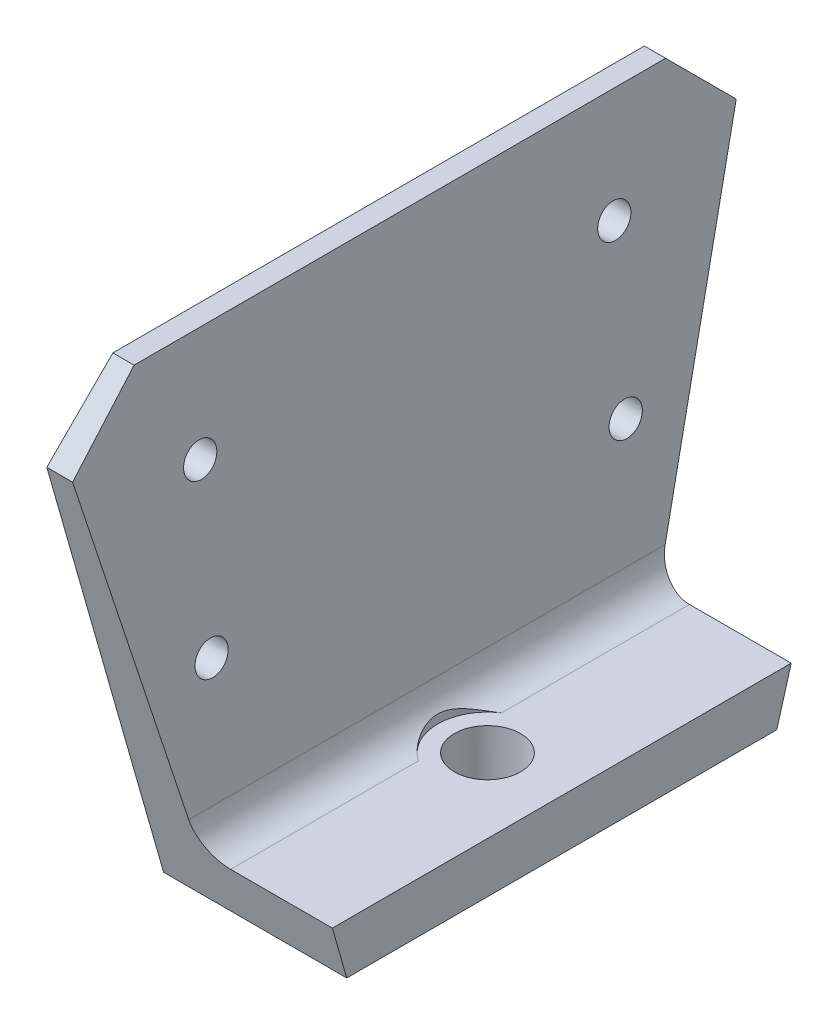
ISO-10303-21;
HEADER;
FILE_DESCRIPTION(('STEP AP214'),'2;1');
FILE_NAME('part.step','',(''),(''),'','','');
FILE_SCHEMA(('AUTOMOTIVE_DESIGN { 1 0 10303 214 1 1 1 1 }'));
ENDSEC;
DATA;
#1=APPLICATION_CONTEXT('core data for automotive mechanical design processes');
#2=APPLICATION_PROTOCOL_DEFINITION('international standard','automotive_design',2000,#1);
#3=PRODUCT_CONTEXT('',#1,'mechanical');
#4=PRODUCT('Part','Part','',(#3));
#5=PRODUCT_RELATED_PRODUCT_CATEGORY('part','',(#4));
#6=PRODUCT_DEFINITION_FORMATION('','',#4);
#7=PRODUCT_DEFINITION_CONTEXT('part definition',#1,'design');
#8=PRODUCT_DEFINITION('design','',#6,#7);
#9=PRODUCT_DEFINITION_SHAPE('','',#8);
#10=(LENGTH_UNIT() NAMED_UNIT(*) SI_UNIT(.MILLI.,.METRE.));
#11=(NAMED_UNIT(*) PLANE_ANGLE_UNIT() SI_UNIT($,.RADIAN.));
#12=(NAMED_UNIT(*) SI_UNIT($,.STERADIAN.) SOLID_ANGLE_UNIT());
#13=UNCERTAINTY_MEASURE_WITH_UNIT(LENGTH_MEASURE(1.E-05),#10,'distance_accuracy_value','');
#14=(GEOMETRIC_REPRESENTATION_CONTEXT(3) GLOBAL_UNCERTAINTY_ASSIGNED_CONTEXT((#13)) GLOBAL_UNIT_ASSIGNED_CONTEXT((#10,
#11,#12)) REPRESENTATION_CONTEXT('',''));
#15=CARTESIAN_POINT('',(0.,0.,0.));
#16=DIRECTION('',(0.,0.,1.));
#17=DIRECTION('',(1.,0.,0.));
#18=AXIS2_PLACEMENT_3D('',#15,#16,#17);
#19=CARTESIAN_POINT('',(15.5804266450344,16.002,-63.5));
#20=DIRECTION('',(0.,0.,-1.));
#21=DIRECTION('',(-1.,0.,0.));
#22=AXIS2_PLACEMENT_3D('',#19,#20,#21);
#23=CYLINDRICAL_SURFACE('',#22,6.35);
#24=CARTESIAN_POINT('',(15.5804266450344,9.652,-7.94912566791189));
#25=CARTESIAN_POINT('',(15.4866178796568,9.65199987984884,-7.8872007381373));
#26=CARTESIAN_POINT('',(15.3939294626452,9.65407882494516,-7.82362588537453));
#27=CARTESIAN_POINT('',(15.2109902696589,9.66209480958907,-7.69333660477531));
#28=CARTESIAN_POINT('',(15.1207388861002,9.66803087808099,-7.62662297106737));
#29=CARTESIAN_POINT('',(14.8542249383108,9.69114545143452,-7.42224176508008));
#30=CARTESIAN_POINT('',(14.6818222816593,9.71363277141685,-7.28008256980195));
#31=CARTESIAN_POINT('',(14.349845034167,9.77012088469824,-6.98626688059203));
#32=CARTESIAN_POINT('',(14.1901810993997,9.80403076914379,-6.83469285357447));
#33=CARTESIAN_POINT('',(13.8827212495261,9.88109919331145,-6.52202673702526));
#34=CARTESIAN_POINT('',(13.7349320637363,9.92426292699442,-6.36092933918632));
#35=CARTESIAN_POINT('',(13.4166388918559,10.0291348075977,-5.98925040348957));
#36=CARTESIAN_POINT('',(13.2495574219044,10.0927891273997,-5.77628461721826));
#37=CARTESIAN_POINT('',(12.9349545066472,10.2267756419168,-5.33837043242594));
#38=CARTESIAN_POINT('',(12.7874366052641,10.2971090425921,-5.11341987319146));
#39=CARTESIAN_POINT('',(12.5116974261914,10.4405584760038,-4.65159095184914));
#40=CARTESIAN_POINT('',(12.3835502455332,10.5136839169675,-4.41467119447196));
#41=CARTESIAN_POINT('',(12.1476126435577,10.6580861557678,-3.930534248618));
#42=CARTESIAN_POINT('',(12.0398180412063,10.729363330693,-3.68331918787182));
#43=CARTESIAN_POINT('',(11.7827837322416,10.909027692573,-3.01757429872754));
#44=CARTESIAN_POINT('',(11.6510220690074,11.0120540989771,-2.59043737470365));
#45=CARTESIAN_POINT('',(11.4988737037087,11.1370529257176,-1.93474135373086));
#46=CARTESIAN_POINT('',(11.4557723771623,11.1737608706523,-1.71403866288394));
#47=CARTESIAN_POINT('',(11.3851408876663,11.2350008316863,-1.26841186585909));
#48=CARTESIAN_POINT('',(11.357609670217,11.2595336723417,-1.04348804662712));
#49=CARTESIAN_POINT('',(11.3184702207533,11.2946715834466,-0.589036712634879));
#50=CARTESIAN_POINT('',(11.3070125156307,11.3051449495666,-0.3594858355869));
#51=CARTESIAN_POINT('',(11.3007543962403,11.3108460279127,0.100032138651571));
#52=CARTESIAN_POINT('',(11.305953401553,11.3060742713701,0.329999221059896));
#53=CARTESIAN_POINT('',(11.3329125420287,11.2816774505881,0.78853216592827));
#54=CARTESIAN_POINT('',(11.354700393816,11.2620275282325,1.01709503728306));
#55=CARTESIAN_POINT('',(11.4144218937142,11.2094570213784,1.47054446327617));
#56=CARTESIAN_POINT('',(11.4523583449074,11.1765341330042,1.69543037262488));
#57=CARTESIAN_POINT('',(11.5499314061995,11.0946397871656,2.17012718334521));
#58=CARTESIAN_POINT('',(11.6118061514131,11.044101789087,2.41920439580497));
#59=CARTESIAN_POINT('',(11.7546650796128,10.9330538262617,2.90955131661991));
#60=CARTESIAN_POINT('',(11.8356561201701,10.8725402853525,3.15081818777743));
#61=CARTESIAN_POINT('',(12.0162530419532,10.7454433559861,3.62537911777131));
#62=CARTESIAN_POINT('',(12.1159082832159,10.6788441179133,3.85865004908461));
#63=CARTESIAN_POINT('',(12.3331871122988,10.5435833635475,4.31600186599302));
#64=CARTESIAN_POINT('',(12.4508091466616,10.4749220259612,4.54008354399311));
#65=CARTESIAN_POINT('',(12.7070959051095,10.3373566044929,4.984380123176));
#66=CARTESIAN_POINT('',(12.8462369892425,10.2684946107931,5.20433377790991));
#67=CARTESIAN_POINT('',(13.1429593203066,10.1361966130445,5.63327491233304));
#68=CARTESIAN_POINT('',(13.3005446330772,10.0727618107187,5.8422599593445));
#69=CARTESIAN_POINT('',(13.6330133527341,9.95543027700948,6.24708257793444));
#70=CARTESIAN_POINT('',(13.807807101131,9.90148780537821,6.44298020969665));
#71=CARTESIAN_POINT('',(14.1746511812191,9.80666715569429,6.82113517678205));
#72=CARTESIAN_POINT('',(14.3666872257053,9.7657782869351,7.00340358006039));
#73=CARTESIAN_POINT('',(14.7259597863939,9.70768871754031,7.31677974782472));
#74=CARTESIAN_POINT('',(14.8902152898504,9.68735099084689,7.45071797184246));
#75=CARTESIAN_POINT('',(15.2283962772145,9.65948769530974,7.70814641122609));
#76=CARTESIAN_POINT('',(15.4023455491996,9.65199521894983,7.8316088639111));
#77=CARTESIAN_POINT('',(15.5804266450344,9.652,7.94912566791189));
#78=B_SPLINE_CURVE_WITH_KNOTS('',3,(#24,#25,#26,#27,#28,#29,#30,#31,#32,#33,#34,#35,#36,#37,#38,
#39,#40,#41,#42,#43,#44,#45,#46,#47,#48,#49,#50,#51,#52,#53,#54,#55,#56,#57,#58,#59,#60,#61,#62,
#63,#64,#65,#66,#67,#68,#69,#70,#71,#72,#73,#74,#75,#76,#77),.UNSPECIFIED.,.F.,.F.,(4,2,2,2,2,2,
2,2,2,2,2,2,2,2,2,2,2,2,2,2,2,2,2,2,2,2,4),(0.,0.337131142183763,0.674177442297792,
1.34690829514942,2.01440683817547,2.6822810173794,3.51534036588812,4.34855041680546,
5.18487112802549,6.02101984634389,7.39100429431739,8.07383850385465,8.75662646229056,
9.44576692251096,10.1348833692166,10.8251537243366,11.5155439458329,12.2991371777659,
13.0830119357554,13.8689898052483,14.6548997553966,15.4617068922918,16.2686922176344,
17.0716756191934,17.8739996921092,18.5119276684856,19.1514966463101),.UNSPECIFIED.);
#79=CARTESIAN_POINT('',(15.5804266450344,9.65199999999999,-7.94912566791189));
#80=VERTEX_POINT('',#79);
#81=CARTESIAN_POINT('',(15.5804266450344,9.65199999999999,7.94912566791189));
#82=VERTEX_POINT('',#81);
#83=EDGE_CURVE('E11',#80,#82,#78,.T.);
#84=ORIENTED_EDGE('',*,*,#83,.F.);
#85=DIRECTION('',(0.,0.,-1.));
#86=VECTOR('',#85,1.);
#87=CARTESIAN_POINT('',(15.5804266450344,9.65199999999999,0.));
#88=LINE('',#87,#86);
#89=CARTESIAN_POINT('',(15.5804266450344,9.65199999999999,-43.9036280260708));
#90=VERTEX_POINT('',#89);
#91=EDGE_CURVE('E124',#90,#80,#88,.F.);
#92=ORIENTED_EDGE('',*,*,#91,.F.);
#93=CARTESIAN_POINT('',(15.5804266450344,16.002,-45.7165412011173));
#94=DIRECTION('',(0.,0.274528965438767,0.961578830432077));
#95=DIRECTION('',(0.,0.961578830432077,-0.274528965438767));
#96=AXIS2_PLACEMENT_3D('',#93,#94,#95);
#97=ELLIPSE('',#96,6.60372275161953,6.35);
#98=CARTESIAN_POINT('',(9.24538049158467,15.5664655769503,-45.5921969343877));
#99=VERTEX_POINT('',#98);
#100=EDGE_CURVE('E54',#99,#90,#97,.T.);
#101=ORIENTED_EDGE('',*,*,#100,.F.);
#102=DIRECTION('',(0.,0.,-1.));
#103=VECTOR('',#102,1.);
#104=CARTESIAN_POINT('',(9.24538049158467,15.5664655769503,-63.5));
#105=LINE('',#104,#103);
#106=CARTESIAN_POINT('',(9.24538049158467,15.5664655769503,45.5921969343877));
#107=VERTEX_POINT('',#106);
#108=EDGE_CURVE('E132',#107,#99,#105,.T.);
#109=ORIENTED_EDGE('',*,*,#108,.F.);
#110=CARTESIAN_POINT('',(15.5804266450344,16.002,45.7165412011173));
#111=DIRECTION('',(0.,-0.274528965438767,0.961578830432077));
#112=DIRECTION('',(0.,-0.961578830432077,-0.274528965438767));
#113=AXIS2_PLACEMENT_3D('',#110,#111,#112);
#114=ELLIPSE('',#113,6.60372275161953,6.35);
#115=CARTESIAN_POINT('',(15.5804266450344,9.65199999999999,43.9036280260708));
#116=VERTEX_POINT('',#115);
#117=EDGE_CURVE('E47',#116,#107,#114,.F.);
#118=ORIENTED_EDGE('',*,*,#117,.F.);
#119=EDGE_CURVE('E62',#82,#116,#88,.F.);
#120=ORIENTED_EDGE('',*,*,#119,.F.);
#121=EDGE_LOOP('',(#84,#92,#101,#109,#118,#120));
#122=FACE_BOUND('',#121,.T.);
#123=ADVANCED_FACE('F35',(#122),#23,.F.);
#124=CARTESIAN_POINT('',(20.828,0.,0.));
#125=DIRECTION('',(0.,1.,0.));
#126=DIRECTION('',(0.,0.,1.));
#127=AXIS2_PLACEMENT_3D('',#124,#125,#126);
#128=CYLINDRICAL_SURFACE('',#127,6.35);
#129=CARTESIAN_POINT('',(20.828,0.,0.));
#130=DIRECTION('',(0.,1.,0.));
#131=DIRECTION('',(0.,0.,1.));
#132=AXIS2_PLACEMENT_3D('',#129,#130,#131);
#133=CIRCLE('',#132,6.35);
#134=CARTESIAN_POINT('',(20.828,0.,6.35));
#135=VERTEX_POINT('',#134);
#136=EDGE_CURVE('E120',#135,#135,#133,.T.);
#137=ORIENTED_EDGE('',*,*,#136,.F.);
#138=EDGE_LOOP('',(#137));
#139=FACE_BOUND('',#138,.T.);
#140=CARTESIAN_POINT('',(20.828,9.65199999999999,0.));
#141=DIRECTION('',(0.,-1.,0.));
#142=DIRECTION('',(0.,0.,-1.));
#143=AXIS2_PLACEMENT_3D('',#140,#141,#142);
#144=CIRCLE('',#143,6.35);
#145=CARTESIAN_POINT('',(20.828,9.65199999999999,-6.35));
#146=VERTEX_POINT('',#145);
#147=EDGE_CURVE('E225',#146,#146,#144,.T.);
#148=ORIENTED_EDGE('',*,*,#147,.F.);
#149=EDGE_LOOP('',(#148));
#150=FACE_BOUND('',#149,.T.);
#151=ADVANCED_FACE('F233',(#139,#150),#128,.F.);
#152=CARTESIAN_POINT('',(9.652,-10.8623001255028,38.0468335419159));
#153=DIRECTION('',(0.,-0.274528965438767,0.961578830432077));
#154=DIRECTION('',(0.,-0.961578830432077,-0.274528965438767));
#155=AXIS2_PLACEMENT_3D('',#152,#153,#154);
#156=PLANE('',#155);
#157=DIRECTION('',(-1.,0.,0.));
#158=VECTOR('',#157,1.);
#159=CARTESIAN_POINT('',(35.052,9.65199999999999,43.9036280260708));
#160=LINE('',#159,#158);
#161=CARTESIAN_POINT('',(35.052,9.65199999999999,43.9036280260708));
#162=VERTEX_POINT('',#161);
#163=EDGE_CURVE('E141',#162,#116,#160,.T.);
#164=ORIENTED_EDGE('',*,*,#163,.T.);
#165=ORIENTED_EDGE('',*,*,#117,.T.);
#166=DIRECTION('',(-0.0659645579760962,0.959484479652309,0.273931032191238));
#167=VECTOR('',#166,1.);
#168=CARTESIAN_POINT('',(11.0562212099716,-10.7730357814049,38.072318345928));
#169=LINE('',#168,#167);
#170=CARTESIAN_POINT('',(4.93305302690583,78.2912286995516,63.5));
#171=VERTEX_POINT('',#170);
#172=EDGE_CURVE('E138',#107,#171,#169,.T.);
#173=ORIENTED_EDGE('',*,*,#172,.T.);
#174=DIRECTION('',(-1.,0.,0.));
#175=VECTOR('',#174,1.);
#176=CARTESIAN_POINT('',(9.652,78.2912286995515,63.5));
#177=LINE('',#176,#175);
#178=CARTESIAN_POINT('',(0.,78.2912286995515,63.5));
#179=VERTEX_POINT('',#178);
#180=EDGE_CURVE('E165',#171,#179,#177,.T.);
#181=ORIENTED_EDGE('',*,*,#180,.T.);
#182=DIRECTION('',(0.,0.961578830432077,0.274528965438767));
#183=VECTOR('',#182,1.);
#184=CARTESIAN_POINT('',(0.,-10.8623001255028,38.0468335419159));
#185=LINE('',#184,#183);
#186=CARTESIAN_POINT('',(0.,0.,41.148));
#187=VERTEX_POINT('',#186);
#188=EDGE_CURVE('E194',#187,#179,#185,.T.);
#189=ORIENTED_EDGE('',*,*,#188,.F.);
#190=DIRECTION('',(-1.,0.,0.));
#191=VECTOR('',#190,1.);
#192=CARTESIAN_POINT('',(9.652,0.,41.148));
#193=LINE('',#192,#191);
#194=CARTESIAN_POINT('',(35.052,0.,41.148));
#195=VERTEX_POINT('',#194);
#196=EDGE_CURVE('E151',#195,#187,#193,.T.);
#197=ORIENTED_EDGE('',*,*,#196,.F.);
#198=DIRECTION('',(0.,0.961578830432077,0.274528965438767));
#199=VECTOR('',#198,1.);
#200=CARTESIAN_POINT('',(35.052,-10.8623001255028,38.0468335419159));
#201=LINE('',#200,#199);
#202=EDGE_CURVE('E199',#195,#162,#201,.T.);
#203=ORIENTED_EDGE('',*,*,#202,.T.);
#204=EDGE_LOOP('',(#164,#165,#173,#181,#189,#197,#203));
#205=FACE_BOUND('',#204,.T.);
#206=ADVANCED_FACE('F137',(#205),#156,.T.);
#207=CARTESIAN_POINT('',(9.652,-10.8623001255028,-38.0468335419159));
#208=DIRECTION('',(0.,0.274528965438767,0.961578830432077));
#209=DIRECTION('',(0.,-0.961578830432077,0.274528965438767));
#210=AXIS2_PLACEMENT_3D('',#207,#208,#209);
#211=PLANE('',#210);
#212=DIRECTION('',(-0.0659645579760962,0.959484479652309,-0.273931032191238));
#213=VECTOR('',#212,1.);
#214=CARTESIAN_POINT('',(11.0562212099716,-10.7730357814049,-38.072318345928));
#215=LINE('',#214,#213);
#216=CARTESIAN_POINT('',(4.93305302690583,78.2912286995516,-63.5));
#217=VERTEX_POINT('',#216);
#218=EDGE_CURVE('E207',#99,#217,#215,.T.);
#219=ORIENTED_EDGE('',*,*,#218,.F.);
#220=ORIENTED_EDGE('',*,*,#100,.T.);
#221=DIRECTION('',(-1.,0.,0.));
#222=VECTOR('',#221,1.);
#223=CARTESIAN_POINT('',(35.052,9.65199999999999,-43.9036280260708));
#224=LINE('',#223,#222);
#225=CARTESIAN_POINT('',(35.052,9.65199999999999,-43.9036280260708));
#226=VERTEX_POINT('',#225);
#227=EDGE_CURVE('E129',#226,#90,#224,.T.);
#228=ORIENTED_EDGE('',*,*,#227,.F.);
#229=DIRECTION('',(0.,0.961578830432077,-0.274528965438767));
#230=VECTOR('',#229,1.);
#231=CARTESIAN_POINT('',(35.052,-10.8623001255028,-38.0468335419159));
#232=LINE('',#231,#230);
#233=CARTESIAN_POINT('',(35.052,0.,-41.148));
#234=VERTEX_POINT('',#233);
#235=EDGE_CURVE('E203',#234,#226,#232,.T.);
#236=ORIENTED_EDGE('',*,*,#235,.F.);
#237=DIRECTION('',(-1.,0.,0.));
#238=VECTOR('',#237,1.);
#239=CARTESIAN_POINT('',(9.652,0.,-41.148));
#240=LINE('',#239,#238);
#241=CARTESIAN_POINT('',(0.,0.,-41.148));
#242=VERTEX_POINT('',#241);
#243=EDGE_CURVE('E152',#234,#242,#240,.T.);
#244=ORIENTED_EDGE('',*,*,#243,.T.);
#245=DIRECTION('',(0.,0.961578830432077,-0.274528965438767));
#246=VECTOR('',#245,1.);
#247=CARTESIAN_POINT('',(0.,-10.8623001255028,-38.0468335419159));
#248=LINE('',#247,#246);
#249=CARTESIAN_POINT('',(0.,78.2912286995515,-63.5));
#250=VERTEX_POINT('',#249);
#251=EDGE_CURVE('E188',#242,#250,#248,.T.);
#252=ORIENTED_EDGE('',*,*,#251,.T.);
#253=DIRECTION('',(-1.,0.,0.));
#254=VECTOR('',#253,1.);
#255=CARTESIAN_POINT('',(9.652,78.2912286995515,-63.5));
#256=LINE('',#255,#254);
#257=EDGE_CURVE('E157',#217,#250,#256,.T.);
#258=ORIENTED_EDGE('',*,*,#257,.F.);
#259=EDGE_LOOP('',(#219,#220,#228,#236,#244,#252,#258));
#260=FACE_BOUND('',#259,.T.);
#261=ADVANCED_FACE('F264',(#260),#211,.F.);
#262=CARTESIAN_POINT('',(9.652,70.8956143497756,-70.8956143497759));
#263=DIRECTION('',(0.,-0.707106781186546,0.707106781186549));
#264=DIRECTION('',(0.,-0.707106781186549,-0.707106781186546));
#265=AXIS2_PLACEMENT_3D('',#262,#263,#264);
#266=PLANE('',#265);
#267=DIRECTION('',(-0.0485562490290554,0.706272713149897,0.706272713149894));
#268=VECTOR('',#267,1.);
#269=CARTESIAN_POINT('',(5.45142864497554,70.7512197094467,-71.0400089901048));
#270=LINE('',#269,#268);
#271=CARTESIAN_POINT('',(4.064,90.932,-50.8592286995516));
#272=VERTEX_POINT('',#271);
#273=EDGE_CURVE('E209',#217,#272,#270,.T.);
#274=ORIENTED_EDGE('',*,*,#273,.F.);
#275=ORIENTED_EDGE('',*,*,#257,.T.);
#276=DIRECTION('',(0.,0.707106781186549,0.707106781186546));
#277=VECTOR('',#276,1.);
#278=CARTESIAN_POINT('',(0.,70.8956143497756,-70.8956143497759));
#279=LINE('',#278,#277);
#280=CARTESIAN_POINT('',(0.,90.932,-50.8592286995516));
#281=VERTEX_POINT('',#280);
#282=EDGE_CURVE('E185',#250,#281,#279,.T.);
#283=ORIENTED_EDGE('',*,*,#282,.T.);
#284=DIRECTION('',(-1.,0.,0.));
#285=VECTOR('',#284,1.);
#286=CARTESIAN_POINT('',(9.652,90.932,-50.8592286995516));
#287=LINE('',#286,#285);
#288=EDGE_CURVE('E161',#272,#281,#287,.T.);
#289=ORIENTED_EDGE('',*,*,#288,.F.);
#290=EDGE_LOOP('',(#274,#275,#283,#289));
#291=FACE_BOUND('',#290,.T.);
#292=ADVANCED_FACE('F271',(#291),#266,.F.);
#293=CARTESIAN_POINT('',(9.652,90.932,0.));
#294=DIRECTION('',(0.,1.,0.));
#295=DIRECTION('',(0.,0.,1.));
#296=AXIS2_PLACEMENT_3D('',#293,#294,#295);
#297=PLANE('',#296);
#298=DIRECTION('',(-1.,0.,0.));
#299=VECTOR('',#298,1.);
#300=CARTESIAN_POINT('',(9.652,90.932,50.8592286995516));
#301=LINE('',#300,#299);
#302=CARTESIAN_POINT('',(4.064,90.932,50.8592286995516));
#303=VERTEX_POINT('',#302);
#304=CARTESIAN_POINT('',(0.,90.932,50.8592286995516));
#305=VERTEX_POINT('',#304);
#306=EDGE_CURVE('E163',#303,#305,#301,.T.);
#307=ORIENTED_EDGE('',*,*,#306,.F.);
#308=DIRECTION('',(0.,0.,1.));
#309=VECTOR('',#308,1.);
#310=CARTESIAN_POINT('',(4.064,90.932,-63.5));
#311=LINE('',#310,#309);
#312=EDGE_CURVE('E223',#272,#303,#311,.T.);
#313=ORIENTED_EDGE('',*,*,#312,.F.);
#314=ORIENTED_EDGE('',*,*,#288,.T.);
#315=DIRECTION('',(0.,0.,-1.));
#316=VECTOR('',#315,1.);
#317=CARTESIAN_POINT('',(0.,90.932,0.));
#318=LINE('',#317,#316);
#319=EDGE_CURVE('E182',#305,#281,#318,.T.);
#320=ORIENTED_EDGE('',*,*,#319,.F.);
#321=EDGE_LOOP('',(#307,#313,#314,#320));
#322=FACE_BOUND('',#321,.T.);
#323=ADVANCED_FACE('F279',(#322),#297,.T.);
#324=CARTESIAN_POINT('',(9.652,38.608,39.624));
#325=DIRECTION('',(-1.,0.,0.));
#326=DIRECTION('',(0.,0.,1.));
#327=AXIS2_PLACEMENT_3D('',#324,#325,#326);
#328=CYLINDRICAL_SURFACE('',#327,3.175);
#329=CARTESIAN_POINT('',(0.,38.608,39.624));
#330=DIRECTION('',(1.,0.,0.));
#331=DIRECTION('',(0.,0.,-1.));
#332=AXIS2_PLACEMENT_3D('',#329,#330,#331);
#333=CIRCLE('',#332,3.175);
#334=CARTESIAN_POINT('',(0.,38.608,36.449));
#335=VERTEX_POINT('',#334);
#336=EDGE_CURVE('E170',#335,#335,#333,.T.);
#337=ORIENTED_EDGE('',*,*,#336,.F.);
#338=EDGE_LOOP('',(#337));
#339=FACE_BOUND('',#338,.T.);
#340=CARTESIAN_POINT('',(7.661275,38.608,39.624));
#341=DIRECTION('',(0.997645063535398,0.0685880981180586,0.));
#342=DIRECTION('',(-0.0685880981180586,0.997645063535398,0.));
#343=AXIS2_PLACEMENT_3D('',#340,#341,#342);
#344=ELLIPSE('',#343,3.18249457251722,3.175);
#345=CARTESIAN_POINT('',(7.44299375,41.783,39.624));
#346=VERTEX_POINT('',#345);
#347=EDGE_CURVE('E211',#346,#346,#344,.T.);
#348=ORIENTED_EDGE('',*,*,#347,.T.);
#349=EDGE_LOOP('',(#348));
#350=FACE_BOUND('',#349,.T.);
#351=ADVANCED_FACE('F288',(#339,#350),#328,.F.);
#352=CARTESIAN_POINT('',(9.652,70.358,-39.624));
#353=DIRECTION('',(-1.,0.,0.));
#354=DIRECTION('',(0.,0.,1.));
#355=AXIS2_PLACEMENT_3D('',#352,#353,#354);
#356=CYLINDRICAL_SURFACE('',#355,3.175);
#357=CARTESIAN_POINT('',(0.,70.358,-39.624));
#358=DIRECTION('',(1.,0.,0.));
#359=DIRECTION('',(0.,0.,-1.));
#360=AXIS2_PLACEMENT_3D('',#357,#358,#359);
#361=CIRCLE('',#360,3.175);
#362=CARTESIAN_POINT('',(0.,70.358,-42.799));
#363=VERTEX_POINT('',#362);
#364=EDGE_CURVE('E173',#363,#363,#361,.F.);
#365=ORIENTED_EDGE('',*,*,#364,.T.);
#366=EDGE_LOOP('',(#365));
#367=FACE_BOUND('',#366,.T.);
#368=CARTESIAN_POINT('',(5.4784625,70.358,-39.624));
#369=DIRECTION('',(0.997645063535398,0.0685880981180586,0.));
#370=DIRECTION('',(-0.0685880981180586,0.997645063535398,0.));
#371=AXIS2_PLACEMENT_3D('',#368,#369,#370);
#372=ELLIPSE('',#371,3.18249457251722,3.175);
#373=CARTESIAN_POINT('',(5.26018125,73.533,-39.624));
#374=VERTEX_POINT('',#373);
#375=EDGE_CURVE('E214',#374,#374,#372,.F.);
#376=ORIENTED_EDGE('',*,*,#375,.F.);
#377=EDGE_LOOP('',(#376));
#378=FACE_BOUND('',#377,.T.);
#379=ADVANCED_FACE('F296',(#367,#378),#356,.F.);
#380=CARTESIAN_POINT('',(9.652,38.608,-39.624));
#381=DIRECTION('',(-1.,0.,0.));
#382=DIRECTION('',(0.,0.,1.));
#383=AXIS2_PLACEMENT_3D('',#380,#381,#382);
#384=CYLINDRICAL_SURFACE('',#383,3.175);
#385=CARTESIAN_POINT('',(0.,38.608,-39.624));
#386=DIRECTION('',(1.,0.,0.));
#387=DIRECTION('',(0.,0.,-1.));
#388=AXIS2_PLACEMENT_3D('',#385,#386,#387);
#389=CIRCLE('',#388,3.175);
#390=CARTESIAN_POINT('',(0.,38.608,-42.799));
#391=VERTEX_POINT('',#390);
#392=EDGE_CURVE('E176',#391,#391,#389,.F.);
#393=ORIENTED_EDGE('',*,*,#392,.T.);
#394=EDGE_LOOP('',(#393));
#395=FACE_BOUND('',#394,.T.);
#396=CARTESIAN_POINT('',(7.661275,38.608,-39.624));
#397=DIRECTION('',(0.997645063535398,0.0685880981180586,0.));
#398=DIRECTION('',(-0.0685880981180586,0.997645063535398,0.));
#399=AXIS2_PLACEMENT_3D('',#396,#397,#398);
#400=ELLIPSE('',#399,3.18249457251722,3.175);
#401=CARTESIAN_POINT('',(7.44299375,41.783,-39.624));
#402=VERTEX_POINT('',#401);
#403=EDGE_CURVE('E149',#402,#402,#400,.F.);
#404=ORIENTED_EDGE('',*,*,#403,.F.);
#405=EDGE_LOOP('',(#404));
#406=FACE_BOUND('',#405,.T.);
#407=ADVANCED_FACE('F304',(#395,#406),#384,.F.);
#408=CARTESIAN_POINT('',(9.652,70.8956143497757,70.8956143497759));
#409=DIRECTION('',(0.,0.707106781186546,0.707106781186548));
#410=DIRECTION('',(0.,-0.707106781186549,0.707106781186547));
#411=AXIS2_PLACEMENT_3D('',#408,#409,#410);
#412=PLANE('',#411);
#413=ORIENTED_EDGE('',*,*,#180,.F.);
#414=DIRECTION('',(-0.0485562490290554,0.706272713149896,-0.706272713149894));
#415=VECTOR('',#414,1.);
#416=CARTESIAN_POINT('',(5.45142864497554,70.7512197094467,71.0400089901048));
#417=LINE('',#416,#415);
#418=EDGE_CURVE('E147',#171,#303,#417,.T.);
#419=ORIENTED_EDGE('',*,*,#418,.T.);
#420=ORIENTED_EDGE('',*,*,#306,.T.);
#421=DIRECTION('',(0.,0.707106781186549,-0.707106781186547));
#422=VECTOR('',#421,1.);
#423=CARTESIAN_POINT('',(0.,70.8956143497757,70.8956143497759));
#424=LINE('',#423,#422);
#425=EDGE_CURVE('E179',#179,#305,#424,.T.);
#426=ORIENTED_EDGE('',*,*,#425,.F.);
#427=EDGE_LOOP('',(#413,#419,#420,#426));
#428=FACE_BOUND('',#427,.T.);
#429=ADVANCED_FACE('F312',(#428),#412,.T.);
#430=CARTESIAN_POINT('',(9.652,70.358,39.624));
#431=DIRECTION('',(-1.,0.,0.));
#432=DIRECTION('',(0.,0.,1.));
#433=AXIS2_PLACEMENT_3D('',#430,#431,#432);
#434=CYLINDRICAL_SURFACE('',#433,3.175);
#435=CARTESIAN_POINT('',(0.,70.358,39.624));
#436=DIRECTION('',(1.,0.,0.));
#437=DIRECTION('',(0.,0.,-1.));
#438=AXIS2_PLACEMENT_3D('',#435,#436,#437);
#439=CIRCLE('',#438,3.175);
#440=CARTESIAN_POINT('',(0.,70.358,36.449));
#441=VERTEX_POINT('',#440);
#442=EDGE_CURVE('E167',#441,#441,#439,.T.);
#443=ORIENTED_EDGE('',*,*,#442,.F.);
#444=EDGE_LOOP('',(#443));
#445=FACE_BOUND('',#444,.T.);
#446=CARTESIAN_POINT('',(5.4784625,70.358,39.624));
#447=DIRECTION('',(0.997645063535398,0.0685880981180586,0.));
#448=DIRECTION('',(-0.0685880981180586,0.997645063535398,0.));
#449=AXIS2_PLACEMENT_3D('',#446,#447,#448);
#450=ELLIPSE('',#449,3.18249457251722,3.175);
#451=CARTESIAN_POINT('',(5.26018125,73.533,39.624));
#452=VERTEX_POINT('',#451);
#453=EDGE_CURVE('E220',#452,#452,#450,.T.);
#454=ORIENTED_EDGE('',*,*,#453,.T.);
#455=EDGE_LOOP('',(#454));
#456=FACE_BOUND('',#455,.T.);
#457=ADVANCED_FACE('F320',(#445,#456),#434,.F.);
#458=CARTESIAN_POINT('',(9.652,0.,0.));
#459=DIRECTION('',(0.,-1.,0.));
#460=DIRECTION('',(0.,0.,-1.));
#461=AXIS2_PLACEMENT_3D('',#458,#459,#460);
#462=PLANE('',#461);
#463=ORIENTED_EDGE('',*,*,#136,.T.);
#464=EDGE_LOOP('',(#463));
#465=FACE_BOUND('',#464,.T.);
#466=DIRECTION('',(0.,0.,1.));
#467=VECTOR('',#466,1.);
#468=CARTESIAN_POINT('',(0.,0.,0.));
#469=LINE('',#468,#467);
#470=EDGE_CURVE('E191',#242,#187,#469,.T.);
#471=ORIENTED_EDGE('',*,*,#470,.F.);
#472=ORIENTED_EDGE('',*,*,#243,.F.);
#473=DIRECTION('',(0.,0.,1.));
#474=VECTOR('',#473,1.);
#475=CARTESIAN_POINT('',(35.052,0.,0.));
#476=LINE('',#475,#474);
#477=EDGE_CURVE('E205',#234,#195,#476,.T.);
#478=ORIENTED_EDGE('',*,*,#477,.T.);
#479=ORIENTED_EDGE('',*,*,#196,.T.);
#480=EDGE_LOOP('',(#471,#472,#478,#479));
#481=FACE_BOUND('',#480,.T.);
#482=ADVANCED_FACE('F231',(#465,#481),#462,.T.);
#483=CARTESIAN_POINT('',(0.,0.,0.));
#484=DIRECTION('',(1.,0.,0.));
#485=DIRECTION('',(0.,0.,-1.));
#486=AXIS2_PLACEMENT_3D('',#483,#484,#485);
#487=PLANE('',#486);
#488=ORIENTED_EDGE('',*,*,#188,.T.);
#489=ORIENTED_EDGE('',*,*,#425,.T.);
#490=ORIENTED_EDGE('',*,*,#319,.T.);
#491=ORIENTED_EDGE('',*,*,#282,.F.);
#492=ORIENTED_EDGE('',*,*,#251,.F.);
#493=ORIENTED_EDGE('',*,*,#470,.T.);
#494=EDGE_LOOP('',(#488,#489,#490,#491,#492,#493));
#495=FACE_BOUND('',#494,.T.);
#496=ORIENTED_EDGE('',*,*,#442,.T.);
#497=EDGE_LOOP('',(#496));
#498=FACE_BOUND('',#497,.T.);
#499=ORIENTED_EDGE('',*,*,#336,.T.);
#500=EDGE_LOOP('',(#499));
#501=FACE_BOUND('',#500,.T.);
#502=ORIENTED_EDGE('',*,*,#364,.F.);
#503=EDGE_LOOP('',(#502));
#504=FACE_BOUND('',#503,.T.);
#505=ORIENTED_EDGE('',*,*,#392,.F.);
#506=EDGE_LOOP('',(#505));
#507=FACE_BOUND('',#506,.T.);
#508=ADVANCED_FACE('F240',(#495,#498,#501,#504,#507),#487,.F.);
#509=CARTESIAN_POINT('',(35.052,9.65199999999999,0.));
#510=DIRECTION('',(0.,-1.,0.));
#511=DIRECTION('',(0.,0.,-1.));
#512=AXIS2_PLACEMENT_3D('',#509,#510,#511);
#513=PLANE('',#512);
#514=ORIENTED_EDGE('',*,*,#91,.T.);
#515=CARTESIAN_POINT('',(20.828,9.65199999999999,0.));
#516=DIRECTION('',(0.,1.,0.));
#517=DIRECTION('',(0.,0.,1.));
#518=AXIS2_PLACEMENT_3D('',#515,#516,#517);
#519=CIRCLE('',#518,9.525);
#520=EDGE_CURVE('E116',#80,#82,#519,.T.);
#521=ORIENTED_EDGE('',*,*,#520,.T.);
#522=ORIENTED_EDGE('',*,*,#119,.T.);
#523=ORIENTED_EDGE('',*,*,#163,.F.);
#524=DIRECTION('',(0.,0.,1.));
#525=VECTOR('',#524,1.);
#526=CARTESIAN_POINT('',(35.052,9.65199999999999,0.));
#527=LINE('',#526,#525);
#528=EDGE_CURVE('E201',#226,#162,#527,.T.);
#529=ORIENTED_EDGE('',*,*,#528,.F.);
#530=ORIENTED_EDGE('',*,*,#227,.T.);
#531=EDGE_LOOP('',(#514,#521,#522,#523,#529,#530));
#532=FACE_BOUND('',#531,.T.);
#533=ORIENTED_EDGE('',*,*,#147,.T.);
#534=EDGE_LOOP('',(#533));
#535=FACE_BOUND('',#534,.T.);
#536=ADVANCED_FACE('F126',(#532,#535),#513,.F.);
#537=CARTESIAN_POINT('',(35.052,0.,0.));
#538=DIRECTION('',(1.,0.,0.));
#539=DIRECTION('',(0.,0.,-1.));
#540=AXIS2_PLACEMENT_3D('',#537,#538,#539);
#541=PLANE('',#540);
#542=ORIENTED_EDGE('',*,*,#477,.F.);
#543=ORIENTED_EDGE('',*,*,#235,.T.);
#544=ORIENTED_EDGE('',*,*,#528,.T.);
#545=ORIENTED_EDGE('',*,*,#202,.F.);
#546=EDGE_LOOP('',(#542,#543,#544,#545));
#547=FACE_BOUND('',#546,.T.);
#548=ADVANCED_FACE('F239',(#547),#541,.T.);
#549=CARTESIAN_POINT('',(9.652,9.652,-63.5));
#550=DIRECTION('',(0.997645063535398,0.0685880981180586,0.));
#551=DIRECTION('',(-0.0685880981180586,0.997645063535398,0.));
#552=AXIS2_PLACEMENT_3D('',#549,#550,#551);
#553=PLANE('',#552);
#554=ORIENTED_EDGE('',*,*,#347,.F.);
#555=EDGE_LOOP('',(#554));
#556=FACE_BOUND('',#555,.T.);
#557=ORIENTED_EDGE('',*,*,#453,.F.);
#558=EDGE_LOOP('',(#557));
#559=FACE_BOUND('',#558,.T.);
#560=ORIENTED_EDGE('',*,*,#403,.T.);
#561=EDGE_LOOP('',(#560));
#562=FACE_BOUND('',#561,.T.);
#563=ORIENTED_EDGE('',*,*,#375,.T.);
#564=EDGE_LOOP('',(#563));
#565=FACE_BOUND('',#564,.T.);
#566=ORIENTED_EDGE('',*,*,#172,.F.);
#567=ORIENTED_EDGE('',*,*,#108,.T.);
#568=ORIENTED_EDGE('',*,*,#218,.T.);
#569=ORIENTED_EDGE('',*,*,#273,.T.);
#570=ORIENTED_EDGE('',*,*,#312,.T.);
#571=ORIENTED_EDGE('',*,*,#418,.F.);
#572=EDGE_LOOP('',(#566,#567,#568,#569,#570,#571));
#573=FACE_BOUND('',#572,.T.);
#574=ADVANCED_FACE('F145',(#556,#559,#562,#565,#573),#553,.T.);
#575=CARTESIAN_POINT('',(20.828,90.932,0.));
#576=DIRECTION('',(0.,-1.,0.));
#577=DIRECTION('',(0.,0.,-1.));
#578=AXIS2_PLACEMENT_3D('',#575,#576,#577);
#579=CYLINDRICAL_SURFACE('',#578,9.525);
#580=ORIENTED_EDGE('',*,*,#83,.T.);
#581=ORIENTED_EDGE('',*,*,#520,.F.);
#582=EDGE_LOOP('',(#580,#581));
#583=FACE_BOUND('',#582,.T.);
#584=ADVANCED_FACE('F118',(#583),#579,.F.);
#585=CLOSED_SHELL('',(#123,#151,#206,#261,#292,#323,#351,#379,#407,#429,#457,#482,#508,#536,
#548,#574,#584));
#586=MANIFOLD_SOLID_BREP('B2',#585);
#587=ADVANCED_BREP_SHAPE_REPRESENTATION('',(#18,#586),#14);
#588=SHAPE_DEFINITION_REPRESENTATION(#9,#587);
ENDSEC;
END-ISO-10303-21;
